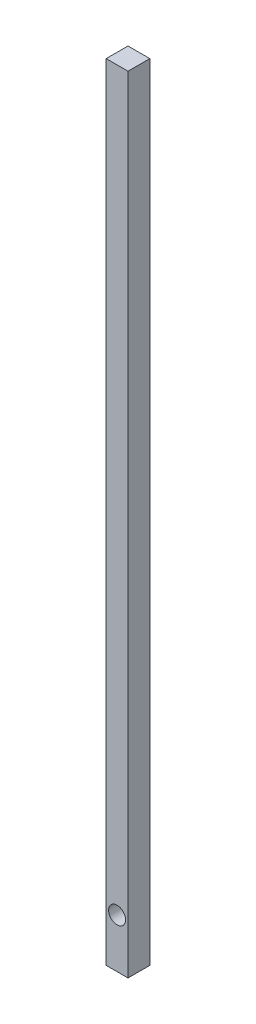
ISO-10303-21;
HEADER;
FILE_DESCRIPTION(('STEP AP214'),'2;1');
FILE_NAME('part.step','',(''),(''),'','','');
FILE_SCHEMA(('AUTOMOTIVE_DESIGN { 1 0 10303 214 1 1 1 1 }'));
ENDSEC;
DATA;
#1=APPLICATION_CONTEXT('core data for automotive mechanical design processes');
#2=APPLICATION_PROTOCOL_DEFINITION('international standard','automotive_design',2000,#1);
#3=PRODUCT_CONTEXT('',#1,'mechanical');
#4=PRODUCT('Part','Part','',(#3));
#5=PRODUCT_RELATED_PRODUCT_CATEGORY('part','',(#4));
#6=PRODUCT_DEFINITION_FORMATION('','',#4);
#7=PRODUCT_DEFINITION_CONTEXT('part definition',#1,'design');
#8=PRODUCT_DEFINITION('design','',#6,#7);
#9=PRODUCT_DEFINITION_SHAPE('','',#8);
#10=(LENGTH_UNIT() NAMED_UNIT(*) SI_UNIT(.MILLI.,.METRE.));
#11=(NAMED_UNIT(*) PLANE_ANGLE_UNIT() SI_UNIT($,.RADIAN.));
#12=(NAMED_UNIT(*) SI_UNIT($,.STERADIAN.) SOLID_ANGLE_UNIT());
#13=UNCERTAINTY_MEASURE_WITH_UNIT(LENGTH_MEASURE(1.E-05),#10,'distance_accuracy_value','');
#14=(GEOMETRIC_REPRESENTATION_CONTEXT(3) GLOBAL_UNCERTAINTY_ASSIGNED_CONTEXT((#13)) GLOBAL_UNIT_ASSIGNED_CONTEXT((#10,
#11,#12)) REPRESENTATION_CONTEXT('',''));
#15=CARTESIAN_POINT('',(0.,0.,0.));
#16=DIRECTION('',(0.,0.,1.));
#17=DIRECTION('',(1.,0.,0.));
#18=AXIS2_PLACEMENT_3D('',#15,#16,#17);
#19=CARTESIAN_POINT('',(-12.7,914.4,12.7));
#20=DIRECTION('',(1.,0.,0.));
#21=DIRECTION('',(0.,0.,-1.));
#22=AXIS2_PLACEMENT_3D('',#19,#20,#21);
#23=PLANE('',#22);
#24=DIRECTION('',(0.,0.,1.));
#25=VECTOR('',#24,1.);
#26=CARTESIAN_POINT('',(-12.7,0.,12.7));
#27=LINE('',#26,#25);
#28=CARTESIAN_POINT('',(-12.7,0.,-12.7));
#29=VERTEX_POINT('',#28);
#30=CARTESIAN_POINT('',(-12.7,0.,12.7));
#31=VERTEX_POINT('',#30);
#32=EDGE_CURVE('E99',#29,#31,#27,.T.);
#33=ORIENTED_EDGE('',*,*,#32,.T.);
#34=DIRECTION('',(0.,-1.,0.));
#35=VECTOR('',#34,1.);
#36=CARTESIAN_POINT('',(-12.7,914.4,12.7));
#37=LINE('',#36,#35);
#38=CARTESIAN_POINT('',(-12.7,914.4,12.7));
#39=VERTEX_POINT('',#38);
#40=EDGE_CURVE('E11',#39,#31,#37,.T.);
#41=ORIENTED_EDGE('',*,*,#40,.F.);
#42=DIRECTION('',(0.,0.,1.));
#43=VECTOR('',#42,1.);
#44=CARTESIAN_POINT('',(-12.7,914.4,12.7));
#45=LINE('',#44,#43);
#46=CARTESIAN_POINT('',(-12.7,914.4,-12.7));
#47=VERTEX_POINT('',#46);
#48=EDGE_CURVE('E87',#47,#39,#45,.T.);
#49=ORIENTED_EDGE('',*,*,#48,.F.);
#50=DIRECTION('',(0.,-1.,0.));
#51=VECTOR('',#50,1.);
#52=CARTESIAN_POINT('',(-12.7,914.4,-12.7));
#53=LINE('',#52,#51);
#54=EDGE_CURVE('E95',#47,#29,#53,.T.);
#55=ORIENTED_EDGE('',*,*,#54,.T.);
#56=EDGE_LOOP('',(#33,#41,#49,#55));
#57=FACE_BOUND('',#56,.T.);
#58=ADVANCED_FACE('F36',(#57),#23,.F.);
#59=CARTESIAN_POINT('',(12.7,914.4,12.7));
#60=DIRECTION('',(0.,0.,-1.));
#61=DIRECTION('',(-1.,0.,0.));
#62=AXIS2_PLACEMENT_3D('',#59,#60,#61);
#63=PLANE('',#62);
#64=CARTESIAN_POINT('',(0.,57.15,12.7));
#65=DIRECTION('',(0.,0.,-1.));
#66=DIRECTION('',(-1.,0.,0.));
#67=AXIS2_PLACEMENT_3D('',#64,#65,#66);
#68=CIRCLE('',#67,9.906);
#69=CARTESIAN_POINT('',(-9.906,57.15,12.7));
#70=VERTEX_POINT('',#69);
#71=EDGE_CURVE('E102',#70,#70,#68,.T.);
#72=ORIENTED_EDGE('',*,*,#71,.T.);
#73=EDGE_LOOP('',(#72));
#74=FACE_BOUND('',#73,.T.);
#75=DIRECTION('',(1.,0.,0.));
#76=VECTOR('',#75,1.);
#77=CARTESIAN_POINT('',(12.7,0.,12.7));
#78=LINE('',#77,#76);
#79=CARTESIAN_POINT('',(12.7,0.,12.7));
#80=VERTEX_POINT('',#79);
#81=EDGE_CURVE('E91',#31,#80,#78,.T.);
#82=ORIENTED_EDGE('',*,*,#81,.T.);
#83=DIRECTION('',(0.,-1.,0.));
#84=VECTOR('',#83,1.);
#85=CARTESIAN_POINT('',(12.7,914.4,12.7));
#86=LINE('',#85,#84);
#87=CARTESIAN_POINT('',(12.7,914.4,12.7));
#88=VERTEX_POINT('',#87);
#89=EDGE_CURVE('E44',#88,#80,#86,.T.);
#90=ORIENTED_EDGE('',*,*,#89,.F.);
#91=DIRECTION('',(1.,0.,0.));
#92=VECTOR('',#91,1.);
#93=CARTESIAN_POINT('',(12.7,914.4,12.7));
#94=LINE('',#93,#92);
#95=EDGE_CURVE('E82',#39,#88,#94,.T.);
#96=ORIENTED_EDGE('',*,*,#95,.F.);
#97=ORIENTED_EDGE('',*,*,#40,.T.);
#98=EDGE_LOOP('',(#82,#90,#96,#97));
#99=FACE_BOUND('',#98,.T.);
#100=ADVANCED_FACE('F90',(#74,#99),#63,.F.);
#101=CARTESIAN_POINT('',(12.7,914.4,12.7));
#102=DIRECTION('',(-1.,0.,0.));
#103=DIRECTION('',(0.,0.,1.));
#104=AXIS2_PLACEMENT_3D('',#101,#102,#103);
#105=PLANE('',#104);
#106=DIRECTION('',(0.,0.,-1.));
#107=VECTOR('',#106,1.);
#108=CARTESIAN_POINT('',(12.7,0.,12.7));
#109=LINE('',#108,#107);
#110=CARTESIAN_POINT('',(12.7,0.,-12.7));
#111=VERTEX_POINT('',#110);
#112=EDGE_CURVE('E69',#80,#111,#109,.T.);
#113=ORIENTED_EDGE('',*,*,#112,.T.);
#114=DIRECTION('',(0.,-1.,0.));
#115=VECTOR('',#114,1.);
#116=CARTESIAN_POINT('',(12.7,914.4,-12.7));
#117=LINE('',#116,#115);
#118=CARTESIAN_POINT('',(12.7,914.4,-12.7));
#119=VERTEX_POINT('',#118);
#120=EDGE_CURVE('E92',#119,#111,#117,.T.);
#121=ORIENTED_EDGE('',*,*,#120,.F.);
#122=DIRECTION('',(0.,0.,-1.));
#123=VECTOR('',#122,1.);
#124=CARTESIAN_POINT('',(12.7,914.4,12.7));
#125=LINE('',#124,#123);
#126=EDGE_CURVE('E85',#88,#119,#125,.T.);
#127=ORIENTED_EDGE('',*,*,#126,.F.);
#128=ORIENTED_EDGE('',*,*,#89,.T.);
#129=EDGE_LOOP('',(#113,#121,#127,#128));
#130=FACE_BOUND('',#129,.T.);
#131=ADVANCED_FACE('F93',(#130),#105,.F.);
#132=CARTESIAN_POINT('',(12.7,914.4,-12.7));
#133=DIRECTION('',(0.,0.,1.));
#134=DIRECTION('',(1.,0.,0.));
#135=AXIS2_PLACEMENT_3D('',#132,#133,#134);
#136=PLANE('',#135);
#137=CARTESIAN_POINT('',(0.,57.15,-12.7));
#138=DIRECTION('',(0.,0.,-1.));
#139=DIRECTION('',(-1.,0.,0.));
#140=AXIS2_PLACEMENT_3D('',#137,#138,#139);
#141=CIRCLE('',#140,9.906);
#142=CARTESIAN_POINT('',(-9.906,57.15,-12.7));
#143=VERTEX_POINT('',#142);
#144=EDGE_CURVE('E113',#143,#143,#141,.T.);
#145=ORIENTED_EDGE('',*,*,#144,.F.);
#146=EDGE_LOOP('',(#145));
#147=FACE_BOUND('',#146,.T.);
#148=DIRECTION('',(-1.,0.,0.));
#149=VECTOR('',#148,1.);
#150=CARTESIAN_POINT('',(12.7,0.,-12.7));
#151=LINE('',#150,#149);
#152=EDGE_CURVE('E75',#111,#29,#151,.T.);
#153=ORIENTED_EDGE('',*,*,#152,.T.);
#154=ORIENTED_EDGE('',*,*,#54,.F.);
#155=DIRECTION('',(-1.,0.,0.));
#156=VECTOR('',#155,1.);
#157=CARTESIAN_POINT('',(12.7,914.4,-12.7));
#158=LINE('',#157,#156);
#159=EDGE_CURVE('E52',#119,#47,#158,.T.);
#160=ORIENTED_EDGE('',*,*,#159,.F.);
#161=ORIENTED_EDGE('',*,*,#120,.T.);
#162=EDGE_LOOP('',(#153,#154,#160,#161));
#163=FACE_BOUND('',#162,.T.);
#164=ADVANCED_FACE('F107',(#147,#163),#136,.F.);
#165=CARTESIAN_POINT('',(0.,914.4,0.));
#166=DIRECTION('',(0.,1.,0.));
#167=DIRECTION('',(0.,0.,1.));
#168=AXIS2_PLACEMENT_3D('',#165,#166,#167);
#169=PLANE('',#168);
#170=ORIENTED_EDGE('',*,*,#48,.T.);
#171=ORIENTED_EDGE('',*,*,#95,.T.);
#172=ORIENTED_EDGE('',*,*,#126,.T.);
#173=ORIENTED_EDGE('',*,*,#159,.T.);
#174=EDGE_LOOP('',(#170,#171,#172,#173));
#175=FACE_BOUND('',#174,.T.);
#176=ADVANCED_FACE('F83',(#175),#169,.T.);
#177=CARTESIAN_POINT('',(0.,0.,0.));
#178=DIRECTION('',(0.,1.,0.));
#179=DIRECTION('',(0.,0.,1.));
#180=AXIS2_PLACEMENT_3D('',#177,#178,#179);
#181=PLANE('',#180);
#182=ORIENTED_EDGE('',*,*,#32,.F.);
#183=ORIENTED_EDGE('',*,*,#152,.F.);
#184=ORIENTED_EDGE('',*,*,#112,.F.);
#185=ORIENTED_EDGE('',*,*,#81,.F.);
#186=EDGE_LOOP('',(#182,#183,#184,#185));
#187=FACE_BOUND('',#186,.T.);
#188=ADVANCED_FACE('F110',(#187),#181,.F.);
#189=CARTESIAN_POINT('',(0.,57.15,12.7));
#190=DIRECTION('',(0.,0.,-1.));
#191=DIRECTION('',(-1.,0.,0.));
#192=AXIS2_PLACEMENT_3D('',#189,#190,#191);
#193=CYLINDRICAL_SURFACE('',#192,9.906);
#194=ORIENTED_EDGE('',*,*,#71,.F.);
#195=EDGE_LOOP('',(#194));
#196=FACE_BOUND('',#195,.T.);
#197=ORIENTED_EDGE('',*,*,#144,.T.);
#198=EDGE_LOOP('',(#197));
#199=FACE_BOUND('',#198,.T.);
#200=ADVANCED_FACE('F120',(#196,#199),#193,.F.);
#201=CLOSED_SHELL('',(#58,#100,#131,#164,#176,#188,#200));
#202=MANIFOLD_SOLID_BREP('B2',#201);
#203=ADVANCED_BREP_SHAPE_REPRESENTATION('',(#18,#202),#14);
#204=SHAPE_DEFINITION_REPRESENTATION(#9,#203);
ENDSEC;
END-ISO-10303-21;
